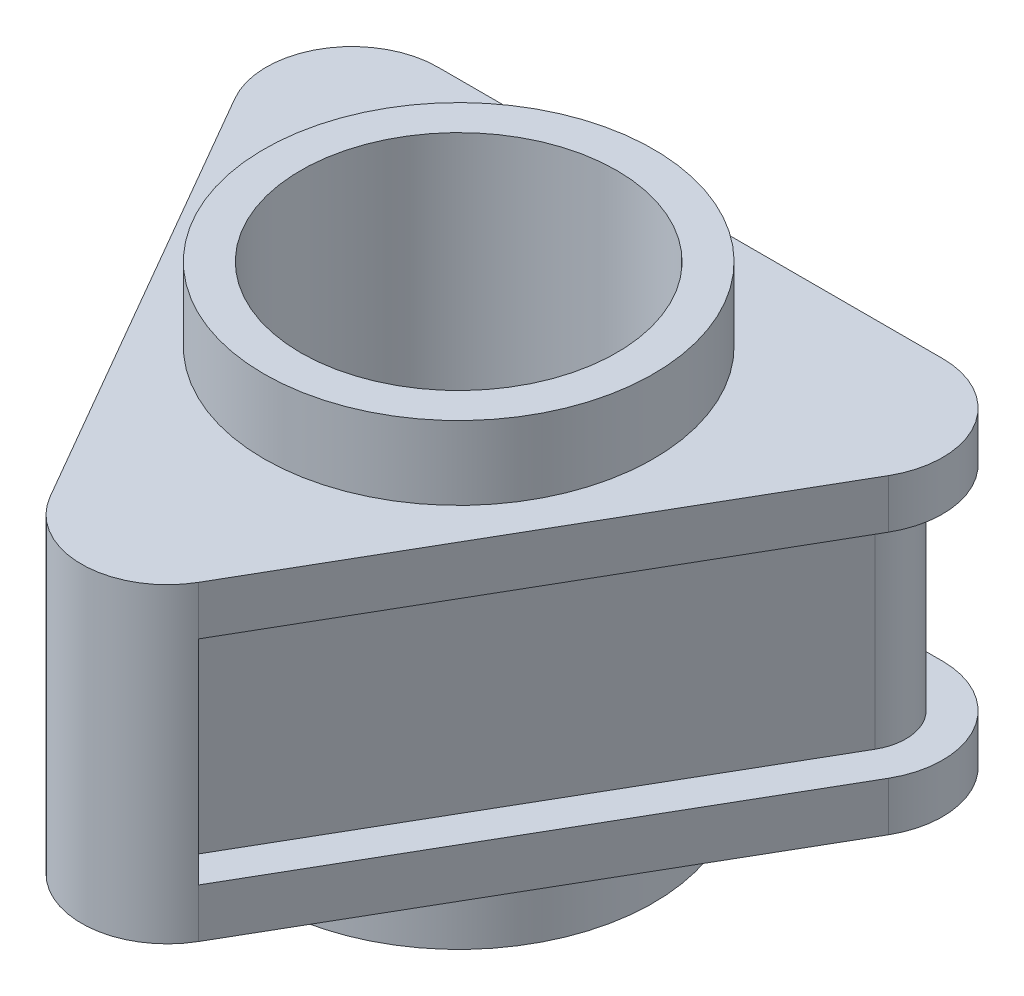
ISO-10303-21;
HEADER;
FILE_DESCRIPTION(('STEP AP214'),'2;1');
FILE_NAME('part.step','',(''),(''),'','','');
FILE_SCHEMA(('AUTOMOTIVE_DESIGN { 1 0 10303 214 1 1 1 1 }'));
ENDSEC;
DATA;
#1=APPLICATION_CONTEXT('core data for automotive mechanical design processes');
#2=APPLICATION_PROTOCOL_DEFINITION('international standard','automotive_design',2000,#1);
#3=PRODUCT_CONTEXT('',#1,'mechanical');
#4=PRODUCT('Part','Part','',(#3));
#5=PRODUCT_RELATED_PRODUCT_CATEGORY('part','',(#4));
#6=PRODUCT_DEFINITION_FORMATION('','',#4);
#7=PRODUCT_DEFINITION_CONTEXT('part definition',#1,'design');
#8=PRODUCT_DEFINITION('design','',#6,#7);
#9=PRODUCT_DEFINITION_SHAPE('','',#8);
#10=(LENGTH_UNIT() NAMED_UNIT(*) SI_UNIT(.MILLI.,.METRE.));
#11=(NAMED_UNIT(*) PLANE_ANGLE_UNIT() SI_UNIT($,.RADIAN.));
#12=(NAMED_UNIT(*) SI_UNIT($,.STERADIAN.) SOLID_ANGLE_UNIT());
#13=UNCERTAINTY_MEASURE_WITH_UNIT(LENGTH_MEASURE(1.E-05),#10,'distance_accuracy_value','');
#14=(GEOMETRIC_REPRESENTATION_CONTEXT(3) GLOBAL_UNCERTAINTY_ASSIGNED_CONTEXT((#13)) GLOBAL_UNIT_ASSIGNED_CONTEXT((#10,
#11,#12)) REPRESENTATION_CONTEXT('',''));
#15=CARTESIAN_POINT('',(0.,0.,0.));
#16=DIRECTION('',(0.,0.,1.));
#17=DIRECTION('',(1.,0.,0.));
#18=AXIS2_PLACEMENT_3D('',#15,#16,#17);
#19=CARTESIAN_POINT('',(0.,6.35,11.9));
#20=DIRECTION('',(0.,-1.,0.));
#21=DIRECTION('',(0.,0.,-1.));
#22=AXIS2_PLACEMENT_3D('',#19,#20,#21);
#23=CYLINDRICAL_SURFACE('',#22,2.);
#24=CARTESIAN_POINT('',(0.,-4.35,11.9));
#25=DIRECTION('',(0.,-1.,0.));
#26=DIRECTION('',(0.,0.,-1.));
#27=AXIS2_PLACEMENT_3D('',#24,#25,#26);
#28=CIRCLE('',#27,2.);
#29=CARTESIAN_POINT('',(-0.999999999999988,-4.35,13.6320508075689));
#30=VERTEX_POINT('',#29);
#31=CARTESIAN_POINT('',(-1.73205080756887,-4.35,12.9));
#32=VERTEX_POINT('',#31);
#33=EDGE_CURVE('E249',#30,#32,#28,.T.);
#34=ORIENTED_EDGE('',*,*,#33,.F.);
#35=DIRECTION('',(0.,1.,0.));
#36=VECTOR('',#35,1.);
#37=CARTESIAN_POINT('',(-0.999999999999987,-10.8162585781888,13.6320508075689));
#38=LINE('',#37,#36);
#39=CARTESIAN_POINT('',(-0.999999999999987,4.35,13.6320508075689));
#40=VERTEX_POINT('',#39);
#41=EDGE_CURVE('E237',#30,#40,#38,.T.);
#42=ORIENTED_EDGE('',*,*,#41,.T.);
#43=CARTESIAN_POINT('',(0.,4.35,11.9));
#44=DIRECTION('',(0.,1.,0.));
#45=DIRECTION('',(0.,0.,1.));
#46=AXIS2_PLACEMENT_3D('',#43,#44,#45);
#47=CIRCLE('',#46,2.);
#48=CARTESIAN_POINT('',(-1.73205080756887,4.35,12.9));
#49=VERTEX_POINT('',#48);
#50=EDGE_CURVE('E317',#49,#40,#47,.T.);
#51=ORIENTED_EDGE('',*,*,#50,.F.);
#52=DIRECTION('',(0.,-1.,0.));
#53=VECTOR('',#52,1.);
#54=CARTESIAN_POINT('',(-1.73205080756887,6.35,12.9));
#55=LINE('',#54,#53);
#56=EDGE_CURVE('E42',#32,#49,#55,.F.);
#57=ORIENTED_EDGE('',*,*,#56,.F.);
#58=EDGE_LOOP('',(#34,#42,#51,#57));
#59=FACE_BOUND('',#58,.T.);
#60=ADVANCED_FACE('F35',(#59),#23,.T.);
#61=CARTESIAN_POINT('',(1.,4.35,13.6320508075689));
#62=VERTEX_POINT('',#61);
#63=CARTESIAN_POINT('',(1.73205080756888,4.35,12.9));
#64=VERTEX_POINT('',#63);
#65=EDGE_CURVE('E316',#62,#64,#47,.T.);
#66=ORIENTED_EDGE('',*,*,#65,.F.);
#67=DIRECTION('',(0.,1.,0.));
#68=VECTOR('',#67,1.);
#69=CARTESIAN_POINT('',(1.00000000000001,-10.8162585781888,13.6320508075689));
#70=LINE('',#69,#68);
#71=CARTESIAN_POINT('',(1.,-4.35,13.6320508075689));
#72=VERTEX_POINT('',#71);
#73=EDGE_CURVE('E239',#72,#62,#70,.T.);
#74=ORIENTED_EDGE('',*,*,#73,.F.);
#75=CARTESIAN_POINT('',(1.73205080756888,-4.35,12.9));
#76=VERTEX_POINT('',#75);
#77=EDGE_CURVE('E250',#76,#72,#28,.T.);
#78=ORIENTED_EDGE('',*,*,#77,.F.);
#79=DIRECTION('',(0.,-1.,0.));
#80=VECTOR('',#79,1.);
#81=CARTESIAN_POINT('',(1.73205080756888,6.35,12.9));
#82=LINE('',#81,#80);
#83=EDGE_CURVE('E388',#64,#76,#82,.T.);
#84=ORIENTED_EDGE('',*,*,#83,.F.);
#85=EDGE_LOOP('',(#66,#74,#78,#84));
#86=FACE_BOUND('',#85,.T.);
#87=ADVANCED_FACE('F480',(#86),#23,.T.);
#88=CARTESIAN_POINT('',(10.3057023050348,4.35,-5.95));
#89=DIRECTION('',(0.,1.,0.));
#90=DIRECTION('',(0.,0.,1.));
#91=AXIS2_PLACEMENT_3D('',#88,#89,#90);
#92=PLANE('',#91);
#93=DIRECTION('',(0.866025403784441,0.,-0.499999999999996));
#94=VECTOR('',#93,1.);
#95=CARTESIAN_POINT('',(-2.16506350946109,4.35,13.15));
#96=LINE('',#95,#94);
#97=CARTESIAN_POINT('',(-3.03108891324553,4.35,13.65));
#98=VERTEX_POINT('',#97);
#99=CARTESIAN_POINT('',(-2.16506350946109,4.35,13.15));
#100=VERTEX_POINT('',#99);
#101=EDGE_CURVE('E232',#98,#100,#96,.T.);
#102=ORIENTED_EDGE('',*,*,#101,.F.);
#103=DIRECTION('',(0.500000000000001,0.,0.866025403784438));
#104=VECTOR('',#103,1.);
#105=CARTESIAN_POINT('',(-13.3367912182804,4.35,-4.2));
#106=LINE('',#105,#104);
#107=CARTESIAN_POINT('',(-13.3367912182804,4.35,-4.2));
#108=VERTEX_POINT('',#107);
#109=EDGE_CURVE('E331',#108,#98,#106,.T.);
#110=ORIENTED_EDGE('',*,*,#109,.F.);
#111=CARTESIAN_POINT('',(-10.3057023050348,4.35,-5.95));
#112=DIRECTION('',(0.,1.,0.));
#113=DIRECTION('',(0.,0.,1.));
#114=AXIS2_PLACEMENT_3D('',#111,#112,#113);
#115=CIRCLE('',#114,3.5);
#116=CARTESIAN_POINT('',(-10.3057023050348,4.35,-9.45));
#117=VERTEX_POINT('',#116);
#118=EDGE_CURVE('E328',#117,#108,#115,.T.);
#119=ORIENTED_EDGE('',*,*,#118,.F.);
#120=DIRECTION('',(-1.,0.,0.));
#121=VECTOR('',#120,1.);
#122=CARTESIAN_POINT('',(10.3057023050348,4.35,-9.45));
#123=LINE('',#122,#121);
#124=CARTESIAN_POINT('',(10.3057023050348,4.35,-9.45));
#125=VERTEX_POINT('',#124);
#126=EDGE_CURVE('E326',#125,#117,#123,.T.);
#127=ORIENTED_EDGE('',*,*,#126,.F.);
#128=CARTESIAN_POINT('',(10.3057023050348,4.35,-5.95));
#129=DIRECTION('',(0.,1.,0.));
#130=DIRECTION('',(0.,0.,1.));
#131=AXIS2_PLACEMENT_3D('',#128,#129,#130);
#132=CIRCLE('',#131,3.5);
#133=CARTESIAN_POINT('',(13.3367912182804,4.35,-4.2));
#134=VERTEX_POINT('',#133);
#135=EDGE_CURVE('E322',#134,#125,#132,.T.);
#136=ORIENTED_EDGE('',*,*,#135,.F.);
#137=DIRECTION('',(0.499999999999999,0.,-0.866025403784439));
#138=VECTOR('',#137,1.);
#139=CARTESIAN_POINT('',(3.03108891324554,4.35,13.65));
#140=LINE('',#139,#138);
#141=CARTESIAN_POINT('',(3.03108891324554,4.35,13.65));
#142=VERTEX_POINT('',#141);
#143=EDGE_CURVE('E320',#142,#134,#140,.T.);
#144=ORIENTED_EDGE('',*,*,#143,.F.);
#145=DIRECTION('',(0.866025403784439,0.,0.499999999999999));
#146=VECTOR('',#145,1.);
#147=CARTESIAN_POINT('',(2.1650635094611,4.35,13.15));
#148=LINE('',#147,#146);
#149=CARTESIAN_POINT('',(2.1650635094611,4.35,13.15));
#150=VERTEX_POINT('',#149);
#151=EDGE_CURVE('E216',#150,#142,#148,.T.);
#152=ORIENTED_EDGE('',*,*,#151,.F.);
#153=CARTESIAN_POINT('',(0.,4.35,11.9));
#154=DIRECTION('',(0.,1.,0.));
#155=DIRECTION('',(0.,0.,-1.));
#156=AXIS2_PLACEMENT_3D('',#153,#154,#155);
#157=CIRCLE('',#156,2.5);
#158=CARTESIAN_POINT('',(1.48431348329845,4.35,13.9116693275234));
#159=VERTEX_POINT('',#158);
#160=EDGE_CURVE('E213',#159,#150,#157,.T.);
#161=ORIENTED_EDGE('',*,*,#160,.F.);
#162=DIRECTION('',(0.866025403784437,0.,0.500000000000002));
#163=VECTOR('',#162,1.);
#164=CARTESIAN_POINT('',(1.00000000000001,4.35,13.6320508075689));
#165=LINE('',#164,#163);
#166=EDGE_CURVE('E242',#62,#159,#165,.T.);
#167=ORIENTED_EDGE('',*,*,#166,.F.);
#168=ORIENTED_EDGE('',*,*,#65,.T.);
#169=DIRECTION('',(0.499999999999999,0.,-0.866025403784439));
#170=VECTOR('',#169,1.);
#171=CARTESIAN_POINT('',(1.73205080756888,4.35,12.9));
#172=LINE('',#171,#170);
#173=CARTESIAN_POINT('',(12.0377531126037,4.35,-4.95));
#174=VERTEX_POINT('',#173);
#175=EDGE_CURVE('E294',#64,#174,#172,.T.);
#176=ORIENTED_EDGE('',*,*,#175,.T.);
#177=CARTESIAN_POINT('',(10.3057023050348,4.35,-5.95));
#178=DIRECTION('',(0.,1.,0.));
#179=DIRECTION('',(0.,0.,1.));
#180=AXIS2_PLACEMENT_3D('',#177,#178,#179);
#181=CIRCLE('',#180,2.);
#182=CARTESIAN_POINT('',(10.3057023050348,4.35,-7.95));
#183=VERTEX_POINT('',#182);
#184=EDGE_CURVE('E306',#174,#183,#181,.T.);
#185=ORIENTED_EDGE('',*,*,#184,.T.);
#186=DIRECTION('',(-1.,0.,0.));
#187=VECTOR('',#186,1.);
#188=CARTESIAN_POINT('',(10.3057023050348,4.35,-7.95));
#189=LINE('',#188,#187);
#190=CARTESIAN_POINT('',(-10.3057023050348,4.35,-7.95));
#191=VERTEX_POINT('',#190);
#192=EDGE_CURVE('E308',#183,#191,#189,.T.);
#193=ORIENTED_EDGE('',*,*,#192,.T.);
#194=CARTESIAN_POINT('',(-10.3057023050348,4.35,-5.95));
#195=DIRECTION('',(0.,1.,0.));
#196=DIRECTION('',(0.,0.,1.));
#197=AXIS2_PLACEMENT_3D('',#194,#195,#196);
#198=CIRCLE('',#197,2.);
#199=CARTESIAN_POINT('',(-12.0377531126037,4.35,-4.95));
#200=VERTEX_POINT('',#199);
#201=EDGE_CURVE('E311',#191,#200,#198,.T.);
#202=ORIENTED_EDGE('',*,*,#201,.T.);
#203=DIRECTION('',(0.500000000000001,0.,0.866025403784438));
#204=VECTOR('',#203,1.);
#205=CARTESIAN_POINT('',(-12.0377531126037,4.35,-4.95));
#206=LINE('',#205,#204);
#207=EDGE_CURVE('E313',#200,#49,#206,.T.);
#208=ORIENTED_EDGE('',*,*,#207,.T.);
#209=ORIENTED_EDGE('',*,*,#50,.T.);
#210=DIRECTION('',(0.86602540378444,0.,-0.499999999999998));
#211=VECTOR('',#210,1.);
#212=CARTESIAN_POINT('',(-0.999999999999988,4.35,13.6320508075689));
#213=LINE('',#212,#211);
#214=CARTESIAN_POINT('',(-1.48431348329843,4.35,13.9116693275234));
#215=VERTEX_POINT('',#214);
#216=EDGE_CURVE('E54',#215,#40,#213,.T.);
#217=ORIENTED_EDGE('',*,*,#216,.F.);
#218=CARTESIAN_POINT('',(0.,4.35,11.9));
#219=DIRECTION('',(0.,1.,0.));
#220=DIRECTION('',(0.,0.,-1.));
#221=AXIS2_PLACEMENT_3D('',#218,#219,#220);
#222=CIRCLE('',#221,2.5);
#223=EDGE_CURVE('E49',#100,#215,#222,.T.);
#224=ORIENTED_EDGE('',*,*,#223,.F.);
#225=EDGE_LOOP('',(#102,#110,#119,#127,#136,#144,#152,#161,#167,#168,#176,#185,#193,#202,#208,
#209,#217,#224));
#226=FACE_BOUND('',#225,.T.);
#227=ADVANCED_FACE('F401',(#226),#92,.F.);
#228=CARTESIAN_POINT('',(10.3057023050348,-4.35,-5.95));
#229=DIRECTION('',(0.,-1.,0.));
#230=DIRECTION('',(0.,0.,-1.));
#231=AXIS2_PLACEMENT_3D('',#228,#229,#230);
#232=PLANE('',#231);
#233=DIRECTION('',(0.866025403784441,0.,-0.499999999999996));
#234=VECTOR('',#233,1.);
#235=CARTESIAN_POINT('',(-2.16506350946109,-4.35,13.15));
#236=LINE('',#235,#234);
#237=CARTESIAN_POINT('',(-3.03108891324553,-4.35,13.65));
#238=VERTEX_POINT('',#237);
#239=CARTESIAN_POINT('',(-2.16506350946109,-4.35,13.15));
#240=VERTEX_POINT('',#239);
#241=EDGE_CURVE('E222',#238,#240,#236,.T.);
#242=ORIENTED_EDGE('',*,*,#241,.T.);
#243=CARTESIAN_POINT('',(0.,-4.35,11.9));
#244=DIRECTION('',(0.,-1.,0.));
#245=DIRECTION('',(0.,0.,-1.));
#246=AXIS2_PLACEMENT_3D('',#243,#244,#245);
#247=CIRCLE('',#246,2.5);
#248=CARTESIAN_POINT('',(-1.48431348329843,-4.35,13.9116693275234));
#249=VERTEX_POINT('',#248);
#250=EDGE_CURVE('E224',#240,#249,#247,.F.);
#251=ORIENTED_EDGE('',*,*,#250,.T.);
#252=DIRECTION('',(0.86602540378444,0.,-0.499999999999998));
#253=VECTOR('',#252,1.);
#254=CARTESIAN_POINT('',(-0.999999999999988,-4.35,13.6320508075689));
#255=LINE('',#254,#253);
#256=EDGE_CURVE('E407',#249,#30,#255,.T.);
#257=ORIENTED_EDGE('',*,*,#256,.T.);
#258=ORIENTED_EDGE('',*,*,#33,.T.);
#259=DIRECTION('',(-0.5,0.,-0.866025403784438));
#260=VECTOR('',#259,1.);
#261=CARTESIAN_POINT('',(-12.0377531126037,-4.35,-4.95));
#262=LINE('',#261,#260);
#263=CARTESIAN_POINT('',(-12.0377531126037,-4.35,-4.95));
#264=VERTEX_POINT('',#263);
#265=EDGE_CURVE('E252',#32,#264,#262,.T.);
#266=ORIENTED_EDGE('',*,*,#265,.T.);
#267=CARTESIAN_POINT('',(-10.3057023050348,-4.35,-5.95));
#268=DIRECTION('',(0.,-1.,0.));
#269=DIRECTION('',(0.,0.,-1.));
#270=AXIS2_PLACEMENT_3D('',#267,#268,#269);
#271=CIRCLE('',#270,2.);
#272=CARTESIAN_POINT('',(-10.3057023050348,-4.35,-7.95));
#273=VERTEX_POINT('',#272);
#274=EDGE_CURVE('E254',#264,#273,#271,.T.);
#275=ORIENTED_EDGE('',*,*,#274,.T.);
#276=DIRECTION('',(1.,0.,0.));
#277=VECTOR('',#276,1.);
#278=CARTESIAN_POINT('',(10.3057023050348,-4.35,-7.95));
#279=LINE('',#278,#277);
#280=CARTESIAN_POINT('',(10.3057023050348,-4.35,-7.95));
#281=VERTEX_POINT('',#280);
#282=EDGE_CURVE('E256',#273,#281,#279,.T.);
#283=ORIENTED_EDGE('',*,*,#282,.T.);
#284=CARTESIAN_POINT('',(10.3057023050348,-4.35,-5.95));
#285=DIRECTION('',(0.,-1.,0.));
#286=DIRECTION('',(0.,0.,-1.));
#287=AXIS2_PLACEMENT_3D('',#284,#285,#286);
#288=CIRCLE('',#287,2.);
#289=CARTESIAN_POINT('',(12.0377531126037,-4.35,-4.95));
#290=VERTEX_POINT('',#289);
#291=EDGE_CURVE('E207',#281,#290,#288,.T.);
#292=ORIENTED_EDGE('',*,*,#291,.T.);
#293=DIRECTION('',(-0.5,0.,0.866025403784439));
#294=VECTOR('',#293,1.);
#295=CARTESIAN_POINT('',(1.73205080756888,-4.35,12.9));
#296=LINE('',#295,#294);
#297=EDGE_CURVE('E247',#290,#76,#296,.T.);
#298=ORIENTED_EDGE('',*,*,#297,.T.);
#299=ORIENTED_EDGE('',*,*,#77,.T.);
#300=DIRECTION('',(0.866025403784438,0.,0.500000000000002));
#301=VECTOR('',#300,1.);
#302=CARTESIAN_POINT('',(1.00000000000001,-4.35,13.6320508075689));
#303=LINE('',#302,#301);
#304=CARTESIAN_POINT('',(1.48431348329845,-4.35,13.9116693275234));
#305=VERTEX_POINT('',#304);
#306=EDGE_CURVE('E203',#72,#305,#303,.T.);
#307=ORIENTED_EDGE('',*,*,#306,.T.);
#308=CARTESIAN_POINT('',(0.,-4.35,11.9));
#309=DIRECTION('',(0.,-1.,0.));
#310=DIRECTION('',(0.,0.,-1.));
#311=AXIS2_PLACEMENT_3D('',#308,#309,#310);
#312=CIRCLE('',#311,2.5);
#313=CARTESIAN_POINT('',(2.1650635094611,-4.35,13.15));
#314=VERTEX_POINT('',#313);
#315=EDGE_CURVE('E194',#305,#314,#312,.F.);
#316=ORIENTED_EDGE('',*,*,#315,.T.);
#317=DIRECTION('',(0.866025403784439,0.,0.499999999999999));
#318=VECTOR('',#317,1.);
#319=CARTESIAN_POINT('',(2.1650635094611,-4.35,13.15));
#320=LINE('',#319,#318);
#321=CARTESIAN_POINT('',(3.03108891324554,-4.35,13.65));
#322=VERTEX_POINT('',#321);
#323=EDGE_CURVE('E199',#314,#322,#320,.T.);
#324=ORIENTED_EDGE('',*,*,#323,.T.);
#325=DIRECTION('',(-0.5,0.,0.866025403784439));
#326=VECTOR('',#325,1.);
#327=CARTESIAN_POINT('',(13.3367912182804,-4.35,-4.2));
#328=LINE('',#327,#326);
#329=CARTESIAN_POINT('',(13.3367912182804,-4.35,-4.2));
#330=VERTEX_POINT('',#329);
#331=EDGE_CURVE('E262',#330,#322,#328,.T.);
#332=ORIENTED_EDGE('',*,*,#331,.F.);
#333=CARTESIAN_POINT('',(10.3057023050348,-4.35,-5.95));
#334=DIRECTION('',(0.,-1.,0.));
#335=DIRECTION('',(0.,0.,-1.));
#336=AXIS2_PLACEMENT_3D('',#333,#334,#335);
#337=CIRCLE('',#336,3.5);
#338=CARTESIAN_POINT('',(10.3057023050348,-4.35,-9.45));
#339=VERTEX_POINT('',#338);
#340=EDGE_CURVE('E259',#339,#330,#337,.T.);
#341=ORIENTED_EDGE('',*,*,#340,.F.);
#342=DIRECTION('',(1.,0.,0.));
#343=VECTOR('',#342,1.);
#344=CARTESIAN_POINT('',(-10.3057023050348,-4.35,-9.45));
#345=LINE('',#344,#343);
#346=CARTESIAN_POINT('',(-10.3057023050348,-4.35,-9.45));
#347=VERTEX_POINT('',#346);
#348=EDGE_CURVE('E272',#347,#339,#345,.T.);
#349=ORIENTED_EDGE('',*,*,#348,.F.);
#350=CARTESIAN_POINT('',(-10.3057023050348,-4.35,-5.95));
#351=DIRECTION('',(0.,-1.,0.));
#352=DIRECTION('',(0.,0.,-1.));
#353=AXIS2_PLACEMENT_3D('',#350,#351,#352);
#354=CIRCLE('',#353,3.5);
#355=CARTESIAN_POINT('',(-13.3367912182804,-4.35,-4.2));
#356=VERTEX_POINT('',#355);
#357=EDGE_CURVE('E269',#356,#347,#354,.T.);
#358=ORIENTED_EDGE('',*,*,#357,.F.);
#359=DIRECTION('',(-0.5,0.,-0.866025403784438));
#360=VECTOR('',#359,1.);
#361=CARTESIAN_POINT('',(-3.03108891324553,-4.35,13.65));
#362=LINE('',#361,#360);
#363=EDGE_CURVE('E266',#238,#356,#362,.T.);
#364=ORIENTED_EDGE('',*,*,#363,.F.);
#365=EDGE_LOOP('',(#242,#251,#257,#258,#266,#275,#283,#292,#298,#299,#307,#316,#324,#332,#341,
#349,#358,#364));
#366=FACE_BOUND('',#365,.T.);
#367=ADVANCED_FACE('F196',(#366),#232,.F.);
#368=CARTESIAN_POINT('',(-13.7698039201726,6.35,-7.95));
#369=DIRECTION('',(0.866025403784438,0.,-0.5));
#370=DIRECTION('',(-0.500000000000001,0.,-0.866025403784438));
#371=AXIS2_PLACEMENT_3D('',#368,#369,#370);
#372=PLANE('',#371);
#373=ORIENTED_EDGE('',*,*,#265,.F.);
#374=ORIENTED_EDGE('',*,*,#56,.T.);
#375=ORIENTED_EDGE('',*,*,#207,.F.);
#376=DIRECTION('',(0.,-1.,0.));
#377=VECTOR('',#376,1.);
#378=CARTESIAN_POINT('',(-12.0377531126037,6.35,-4.95));
#379=LINE('',#378,#377);
#380=EDGE_CURVE('E12',#200,#264,#379,.T.);
#381=ORIENTED_EDGE('',*,*,#380,.T.);
#382=EDGE_LOOP('',(#373,#374,#375,#381));
#383=FACE_BOUND('',#382,.T.);
#384=ADVANCED_FACE('F396',(#383),#372,.F.);
#385=CARTESIAN_POINT('',(0.,6.35,15.9));
#386=DIRECTION('',(-0.866025403784439,0.,-0.5));
#387=DIRECTION('',(-0.5,0.,0.866025403784439));
#388=AXIS2_PLACEMENT_3D('',#385,#386,#387);
#389=PLANE('',#388);
#390=ORIENTED_EDGE('',*,*,#297,.F.);
#391=DIRECTION('',(0.,-1.,0.));
#392=VECTOR('',#391,1.);
#393=CARTESIAN_POINT('',(12.0377531126037,6.35,-4.95));
#394=LINE('',#393,#392);
#395=EDGE_CURVE('E391',#290,#174,#394,.F.);
#396=ORIENTED_EDGE('',*,*,#395,.T.);
#397=ORIENTED_EDGE('',*,*,#175,.F.);
#398=ORIENTED_EDGE('',*,*,#83,.T.);
#399=EDGE_LOOP('',(#390,#396,#397,#398));
#400=FACE_BOUND('',#399,.T.);
#401=ADVANCED_FACE('F514',(#400),#389,.F.);
#402=CARTESIAN_POINT('',(13.7698039201726,6.35,-7.95));
#403=DIRECTION('',(0.,0.,1.));
#404=DIRECTION('',(1.,0.,0.));
#405=AXIS2_PLACEMENT_3D('',#402,#403,#404);
#406=PLANE('',#405);
#407=ORIENTED_EDGE('',*,*,#282,.F.);
#408=DIRECTION('',(0.,-1.,0.));
#409=VECTOR('',#408,1.);
#410=CARTESIAN_POINT('',(-10.3057023050348,6.35,-7.95));
#411=LINE('',#410,#409);
#412=EDGE_CURVE('E383',#273,#191,#411,.F.);
#413=ORIENTED_EDGE('',*,*,#412,.T.);
#414=ORIENTED_EDGE('',*,*,#192,.F.);
#415=DIRECTION('',(0.,-1.,0.));
#416=VECTOR('',#415,1.);
#417=CARTESIAN_POINT('',(10.3057023050348,6.35,-7.95));
#418=LINE('',#417,#416);
#419=EDGE_CURVE('E385',#183,#281,#418,.T.);
#420=ORIENTED_EDGE('',*,*,#419,.T.);
#421=EDGE_LOOP('',(#407,#413,#414,#420));
#422=FACE_BOUND('',#421,.T.);
#423=ADVANCED_FACE('F519',(#422),#406,.F.);
#424=CARTESIAN_POINT('',(10.3057023050348,6.35,-5.95));
#425=DIRECTION('',(0.,-1.,0.));
#426=DIRECTION('',(0.,0.,-1.));
#427=AXIS2_PLACEMENT_3D('',#424,#425,#426);
#428=CYLINDRICAL_SURFACE('',#427,2.);
#429=ORIENTED_EDGE('',*,*,#395,.F.);
#430=ORIENTED_EDGE('',*,*,#291,.F.);
#431=ORIENTED_EDGE('',*,*,#419,.F.);
#432=ORIENTED_EDGE('',*,*,#184,.F.);
#433=EDGE_LOOP('',(#429,#430,#431,#432));
#434=FACE_BOUND('',#433,.T.);
#435=ADVANCED_FACE('F524',(#434),#428,.T.);
#436=CARTESIAN_POINT('',(-10.3057023050348,6.35,-5.95));
#437=DIRECTION('',(0.,-1.,0.));
#438=DIRECTION('',(0.,0.,-1.));
#439=AXIS2_PLACEMENT_3D('',#436,#437,#438);
#440=CYLINDRICAL_SURFACE('',#439,2.);
#441=ORIENTED_EDGE('',*,*,#412,.F.);
#442=ORIENTED_EDGE('',*,*,#274,.F.);
#443=ORIENTED_EDGE('',*,*,#380,.F.);
#444=ORIENTED_EDGE('',*,*,#201,.F.);
#445=EDGE_LOOP('',(#441,#442,#443,#444));
#446=FACE_BOUND('',#445,.T.);
#447=ADVANCED_FACE('F526',(#446),#440,.T.);
#448=CARTESIAN_POINT('',(0.,6.35,15.9));
#449=DIRECTION('',(0.,1.,0.));
#450=DIRECTION('',(0.,0.,1.));
#451=AXIS2_PLACEMENT_3D('',#448,#449,#450);
#452=PLANE('',#451);
#453=CARTESIAN_POINT('',(0.,6.35,0.));
#454=DIRECTION('',(0.,1.,0.));
#455=DIRECTION('',(0.,0.,1.));
#456=AXIS2_PLACEMENT_3D('',#453,#454,#455);
#457=CIRCLE('',#456,7.95000000000001);
#458=CARTESIAN_POINT('',(0.,6.35,7.95000000000001));
#459=VERTEX_POINT('',#458);
#460=EDGE_CURVE('E380',#459,#459,#457,.T.);
#461=ORIENTED_EDGE('',*,*,#460,.F.);
#462=EDGE_LOOP('',(#461));
#463=FACE_BOUND('',#462,.T.);
#464=CARTESIAN_POINT('',(0.,6.35,11.9));
#465=DIRECTION('',(0.,1.,0.));
#466=DIRECTION('',(0.,0.,1.));
#467=AXIS2_PLACEMENT_3D('',#464,#465,#466);
#468=CIRCLE('',#467,3.5);
#469=CARTESIAN_POINT('',(-3.03108891324553,6.35,13.65));
#470=VERTEX_POINT('',#469);
#471=CARTESIAN_POINT('',(3.03108891324554,6.35,13.65));
#472=VERTEX_POINT('',#471);
#473=EDGE_CURVE('E323',#470,#472,#468,.T.);
#474=ORIENTED_EDGE('',*,*,#473,.T.);
#475=DIRECTION('',(0.5,0.,-0.866025403784439));
#476=VECTOR('',#475,1.);
#477=CARTESIAN_POINT('',(8.18394006576295,6.35,4.725));
#478=LINE('',#477,#476);
#479=CARTESIAN_POINT('',(13.3367912182804,6.35,-4.2));
#480=VERTEX_POINT('',#479);
#481=EDGE_CURVE('E319',#472,#480,#478,.T.);
#482=ORIENTED_EDGE('',*,*,#481,.T.);
#483=CARTESIAN_POINT('',(10.3057023050348,6.35,-5.95));
#484=DIRECTION('',(0.,1.,0.));
#485=DIRECTION('',(0.,0.,1.));
#486=AXIS2_PLACEMENT_3D('',#483,#484,#485);
#487=CIRCLE('',#486,3.5);
#488=CARTESIAN_POINT('',(10.3057023050348,6.35,-9.45));
#489=VERTEX_POINT('',#488);
#490=EDGE_CURVE('E337',#480,#489,#487,.T.);
#491=ORIENTED_EDGE('',*,*,#490,.T.);
#492=DIRECTION('',(-1.,0.,0.));
#493=VECTOR('',#492,1.);
#494=CARTESIAN_POINT('',(0.,6.35,-9.45));
#495=LINE('',#494,#493);
#496=CARTESIAN_POINT('',(-10.3057023050348,6.35,-9.45));
#497=VERTEX_POINT('',#496);
#498=EDGE_CURVE('E340',#489,#497,#495,.T.);
#499=ORIENTED_EDGE('',*,*,#498,.T.);
#500=CARTESIAN_POINT('',(-10.3057023050348,6.35,-5.95));
#501=DIRECTION('',(0.,1.,0.));
#502=DIRECTION('',(0.,0.,1.));
#503=AXIS2_PLACEMENT_3D('',#500,#501,#502);
#504=CIRCLE('',#503,3.5);
#505=CARTESIAN_POINT('',(-13.3367912182804,6.35,-4.2));
#506=VERTEX_POINT('',#505);
#507=EDGE_CURVE('E343',#497,#506,#504,.T.);
#508=ORIENTED_EDGE('',*,*,#507,.T.);
#509=DIRECTION('',(0.5,0.,0.866025403784438));
#510=VECTOR('',#509,1.);
#511=CARTESIAN_POINT('',(-8.18394006576294,6.35,4.725));
#512=LINE('',#511,#510);
#513=EDGE_CURVE('E346',#506,#470,#512,.T.);
#514=ORIENTED_EDGE('',*,*,#513,.T.);
#515=EDGE_LOOP('',(#474,#482,#491,#499,#508,#514));
#516=FACE_BOUND('',#515,.T.);
#517=ADVANCED_FACE('F435',(#463,#516),#452,.T.);
#518=CARTESIAN_POINT('',(0.,-6.35,15.9));
#519=DIRECTION('',(0.,1.,0.));
#520=DIRECTION('',(0.,0.,1.));
#521=AXIS2_PLACEMENT_3D('',#518,#519,#520);
#522=PLANE('',#521);
#523=CARTESIAN_POINT('',(0.,-6.35,0.));
#524=DIRECTION('',(0.,1.,0.));
#525=DIRECTION('',(0.,0.,1.));
#526=AXIS2_PLACEMENT_3D('',#523,#524,#525);
#527=CIRCLE('',#526,7.95000000000001);
#528=CARTESIAN_POINT('',(0.,-6.35,7.95000000000001));
#529=VERTEX_POINT('',#528);
#530=EDGE_CURVE('E375',#529,#529,#527,.T.);
#531=ORIENTED_EDGE('',*,*,#530,.T.);
#532=EDGE_LOOP('',(#531));
#533=FACE_BOUND('',#532,.T.);
#534=CARTESIAN_POINT('',(10.3057023050348,-6.35,-5.95));
#535=DIRECTION('',(0.,-1.,0.));
#536=DIRECTION('',(0.,0.,-1.));
#537=AXIS2_PLACEMENT_3D('',#534,#535,#536);
#538=CIRCLE('',#537,3.5);
#539=CARTESIAN_POINT('',(10.3057023050348,-6.35,-9.45));
#540=VERTEX_POINT('',#539);
#541=CARTESIAN_POINT('',(13.3367912182804,-6.35,-4.2));
#542=VERTEX_POINT('',#541);
#543=EDGE_CURVE('E258',#540,#542,#538,.T.);
#544=ORIENTED_EDGE('',*,*,#543,.T.);
#545=DIRECTION('',(-0.5,0.,0.866025403784439));
#546=VECTOR('',#545,1.);
#547=CARTESIAN_POINT('',(13.3367912182804,-6.35,-4.2));
#548=LINE('',#547,#546);
#549=CARTESIAN_POINT('',(3.03108891324554,-6.35,13.65));
#550=VERTEX_POINT('',#549);
#551=EDGE_CURVE('E278',#542,#550,#548,.T.);
#552=ORIENTED_EDGE('',*,*,#551,.T.);
#553=CARTESIAN_POINT('',(0.,-6.35,11.9));
#554=DIRECTION('',(0.,-1.,0.));
#555=DIRECTION('',(0.,0.,-1.));
#556=AXIS2_PLACEMENT_3D('',#553,#554,#555);
#557=CIRCLE('',#556,3.5);
#558=CARTESIAN_POINT('',(-3.03108891324553,-6.35,13.65));
#559=VERTEX_POINT('',#558);
#560=EDGE_CURVE('E281',#550,#559,#557,.T.);
#561=ORIENTED_EDGE('',*,*,#560,.T.);
#562=DIRECTION('',(-0.5,0.,-0.866025403784438));
#563=VECTOR('',#562,1.);
#564=CARTESIAN_POINT('',(-3.03108891324553,-6.35,13.65));
#565=LINE('',#564,#563);
#566=CARTESIAN_POINT('',(-13.3367912182804,-6.35,-4.2));
#567=VERTEX_POINT('',#566);
#568=EDGE_CURVE('E284',#559,#567,#565,.T.);
#569=ORIENTED_EDGE('',*,*,#568,.T.);
#570=CARTESIAN_POINT('',(-10.3057023050348,-6.35,-5.95));
#571=DIRECTION('',(0.,-1.,0.));
#572=DIRECTION('',(0.,0.,-1.));
#573=AXIS2_PLACEMENT_3D('',#570,#571,#572);
#574=CIRCLE('',#573,3.5);
#575=CARTESIAN_POINT('',(-10.3057023050348,-6.35,-9.45));
#576=VERTEX_POINT('',#575);
#577=EDGE_CURVE('E287',#567,#576,#574,.T.);
#578=ORIENTED_EDGE('',*,*,#577,.T.);
#579=DIRECTION('',(1.,0.,0.));
#580=VECTOR('',#579,1.);
#581=CARTESIAN_POINT('',(-10.3057023050348,-6.35,-9.45));
#582=LINE('',#581,#580);
#583=EDGE_CURVE('E263',#576,#540,#582,.T.);
#584=ORIENTED_EDGE('',*,*,#583,.T.);
#585=EDGE_LOOP('',(#544,#552,#561,#569,#578,#584));
#586=FACE_BOUND('',#585,.T.);
#587=ADVANCED_FACE('F469',(#533,#586),#522,.F.);
#588=CARTESIAN_POINT('',(0.,-34.8359956417322,0.));
#589=DIRECTION('',(0.,1.,0.));
#590=DIRECTION('',(0.,0.,1.));
#591=AXIS2_PLACEMENT_3D('',#588,#589,#590);
#592=CYLINDRICAL_SURFACE('',#591,7.95000000000001);
#593=CARTESIAN_POINT('',(0.,-9.35,0.));
#594=DIRECTION('',(0.,1.,0.));
#595=DIRECTION('',(0.,0.,1.));
#596=AXIS2_PLACEMENT_3D('',#593,#594,#595);
#597=CIRCLE('',#596,7.95000000000001);
#598=CARTESIAN_POINT('',(0.,-9.35,7.95000000000001));
#599=VERTEX_POINT('',#598);
#600=EDGE_CURVE('E372',#599,#599,#597,.F.);
#601=ORIENTED_EDGE('',*,*,#600,.F.);
#602=EDGE_LOOP('',(#601));
#603=FACE_BOUND('',#602,.T.);
#604=ORIENTED_EDGE('',*,*,#530,.F.);
#605=EDGE_LOOP('',(#604));
#606=FACE_BOUND('',#605,.T.);
#607=ADVANCED_FACE('F550',(#603,#606),#592,.T.);
#608=CARTESIAN_POINT('',(0.,-9.35,15.9));
#609=DIRECTION('',(0.,1.,0.));
#610=DIRECTION('',(0.,0.,1.));
#611=AXIS2_PLACEMENT_3D('',#608,#609,#610);
#612=PLANE('',#611);
#613=ORIENTED_EDGE('',*,*,#600,.T.);
#614=EDGE_LOOP('',(#613));
#615=FACE_BOUND('',#614,.T.);
#616=CARTESIAN_POINT('',(0.,-9.35,0.));
#617=DIRECTION('',(0.,1.,0.));
#618=DIRECTION('',(0.,0.,1.));
#619=AXIS2_PLACEMENT_3D('',#616,#617,#618);
#620=CIRCLE('',#619,6.45);
#621=CARTESIAN_POINT('',(0.,-9.35,6.45));
#622=VERTEX_POINT('',#621);
#623=EDGE_CURVE('E371',#622,#622,#620,.F.);
#624=ORIENTED_EDGE('',*,*,#623,.F.);
#625=EDGE_LOOP('',(#624));
#626=FACE_BOUND('',#625,.T.);
#627=ADVANCED_FACE('F557',(#615,#626),#612,.F.);
#628=CARTESIAN_POINT('',(0.,6.35,0.));
#629=DIRECTION('',(0.,-1.,0.));
#630=DIRECTION('',(0.,0.,-1.));
#631=AXIS2_PLACEMENT_3D('',#628,#629,#630);
#632=CYLINDRICAL_SURFACE('',#631,6.45);
#633=ORIENTED_EDGE('',*,*,#623,.T.);
#634=EDGE_LOOP('',(#633));
#635=FACE_BOUND('',#634,.T.);
#636=CARTESIAN_POINT('',(0.,9.35,0.));
#637=DIRECTION('',(0.,1.,0.));
#638=DIRECTION('',(0.,0.,1.));
#639=AXIS2_PLACEMENT_3D('',#636,#637,#638);
#640=CIRCLE('',#639,6.45);
#641=CARTESIAN_POINT('',(0.,9.35,6.45));
#642=VERTEX_POINT('',#641);
#643=EDGE_CURVE('E354',#642,#642,#640,.T.);
#644=ORIENTED_EDGE('',*,*,#643,.T.);
#645=EDGE_LOOP('',(#644));
#646=FACE_BOUND('',#645,.T.);
#647=ADVANCED_FACE('F553',(#635,#646),#632,.F.);
#648=CARTESIAN_POINT('',(0.,9.35,0.));
#649=DIRECTION('',(0.,1.,0.));
#650=DIRECTION('',(0.,0.,1.));
#651=AXIS2_PLACEMENT_3D('',#648,#649,#650);
#652=CIRCLE('',#651,7.95000000000001);
#653=CARTESIAN_POINT('',(0.,9.35,7.95000000000001));
#654=VERTEX_POINT('',#653);
#655=EDGE_CURVE('E368',#654,#654,#652,.T.);
#656=ORIENTED_EDGE('',*,*,#655,.F.);
#657=EDGE_LOOP('',(#656));
#658=FACE_BOUND('',#657,.T.);
#659=ORIENTED_EDGE('',*,*,#460,.T.);
#660=EDGE_LOOP('',(#659));
#661=FACE_BOUND('',#660,.T.);
#662=ADVANCED_FACE('F556',(#658,#661),#592,.T.);
#663=CARTESIAN_POINT('',(0.,9.35,0.));
#664=DIRECTION('',(0.,1.,0.));
#665=DIRECTION('',(0.,0.,1.));
#666=AXIS2_PLACEMENT_3D('',#663,#664,#665);
#667=PLANE('',#666);
#668=ORIENTED_EDGE('',*,*,#655,.T.);
#669=EDGE_LOOP('',(#668));
#670=FACE_BOUND('',#669,.T.);
#671=ORIENTED_EDGE('',*,*,#643,.F.);
#672=EDGE_LOOP('',(#671));
#673=FACE_BOUND('',#672,.T.);
#674=ADVANCED_FACE('F565',(#670,#673),#667,.T.);
#675=CARTESIAN_POINT('',(0.,4.35,11.9));
#676=DIRECTION('',(0.,1.,0.));
#677=DIRECTION('',(0.,0.,1.));
#678=AXIS2_PLACEMENT_3D('',#675,#676,#677);
#679=CYLINDRICAL_SURFACE('',#678,3.5);
#680=ORIENTED_EDGE('',*,*,#473,.F.);
#681=DIRECTION('',(0.,1.,0.));
#682=VECTOR('',#681,1.);
#683=CARTESIAN_POINT('',(-3.03108891324553,4.35,13.65));
#684=LINE('',#683,#682);
#685=EDGE_CURVE('E355',#98,#470,#684,.T.);
#686=ORIENTED_EDGE('',*,*,#685,.F.);
#687=DIRECTION('',(0.,1.,0.));
#688=VECTOR('',#687,1.);
#689=CARTESIAN_POINT('',(-3.03108891324553,-10.8162585781888,13.65));
#690=LINE('',#689,#688);
#691=EDGE_CURVE('E229',#238,#98,#690,.T.);
#692=ORIENTED_EDGE('',*,*,#691,.F.);
#693=DIRECTION('',(0.,-1.,0.));
#694=VECTOR('',#693,1.);
#695=CARTESIAN_POINT('',(-3.03108891324553,-4.35,13.65));
#696=LINE('',#695,#694);
#697=EDGE_CURVE('E299',#238,#559,#696,.T.);
#698=ORIENTED_EDGE('',*,*,#697,.T.);
#699=ORIENTED_EDGE('',*,*,#560,.F.);
#700=DIRECTION('',(0.,-1.,0.));
#701=VECTOR('',#700,1.);
#702=CARTESIAN_POINT('',(3.03108891324554,-4.35,13.65));
#703=LINE('',#702,#701);
#704=EDGE_CURVE('E301',#322,#550,#703,.T.);
#705=ORIENTED_EDGE('',*,*,#704,.F.);
#706=DIRECTION('',(0.,1.,0.));
#707=VECTOR('',#706,1.);
#708=CARTESIAN_POINT('',(3.03108891324554,-10.8162585781888,13.65));
#709=LINE('',#708,#707);
#710=EDGE_CURVE('E221',#322,#142,#709,.T.);
#711=ORIENTED_EDGE('',*,*,#710,.T.);
#712=DIRECTION('',(0.,1.,0.));
#713=VECTOR('',#712,1.);
#714=CARTESIAN_POINT('',(3.03108891324554,4.35,13.65));
#715=LINE('',#714,#713);
#716=EDGE_CURVE('E351',#142,#472,#715,.T.);
#717=ORIENTED_EDGE('',*,*,#716,.T.);
#718=EDGE_LOOP('',(#680,#686,#692,#698,#699,#705,#711,#717));
#719=FACE_BOUND('',#718,.T.);
#720=ADVANCED_FACE('F433',(#719),#679,.T.);
#721=CARTESIAN_POINT('',(-8.18394006576294,4.35,4.725));
#722=DIRECTION('',(-0.866025403784438,0.,0.5));
#723=DIRECTION('',(0.5,0.,0.866025403784438));
#724=AXIS2_PLACEMENT_3D('',#721,#722,#723);
#725=PLANE('',#724);
#726=ORIENTED_EDGE('',*,*,#513,.F.);
#727=DIRECTION('',(0.,1.,0.));
#728=VECTOR('',#727,1.);
#729=CARTESIAN_POINT('',(-13.3367912182804,4.35,-4.2));
#730=LINE('',#729,#728);
#731=EDGE_CURVE('E357',#108,#506,#730,.T.);
#732=ORIENTED_EDGE('',*,*,#731,.F.);
#733=ORIENTED_EDGE('',*,*,#109,.T.);
#734=ORIENTED_EDGE('',*,*,#685,.T.);
#735=EDGE_LOOP('',(#726,#732,#733,#734));
#736=FACE_BOUND('',#735,.T.);
#737=ADVANCED_FACE('F430',(#736),#725,.T.);
#738=CARTESIAN_POINT('',(-10.3057023050348,4.35,-5.95));
#739=DIRECTION('',(0.,1.,0.));
#740=DIRECTION('',(0.,0.,1.));
#741=AXIS2_PLACEMENT_3D('',#738,#739,#740);
#742=CYLINDRICAL_SURFACE('',#741,3.5);
#743=ORIENTED_EDGE('',*,*,#507,.F.);
#744=DIRECTION('',(0.,1.,0.));
#745=VECTOR('',#744,1.);
#746=CARTESIAN_POINT('',(-10.3057023050348,4.35,-9.45));
#747=LINE('',#746,#745);
#748=EDGE_CURVE('E360',#117,#497,#747,.T.);
#749=ORIENTED_EDGE('',*,*,#748,.F.);
#750=ORIENTED_EDGE('',*,*,#118,.T.);
#751=ORIENTED_EDGE('',*,*,#731,.T.);
#752=EDGE_LOOP('',(#743,#749,#750,#751));
#753=FACE_BOUND('',#752,.T.);
#754=ADVANCED_FACE('F438',(#753),#742,.T.);
#755=CARTESIAN_POINT('',(0.,4.35,-9.45));
#756=DIRECTION('',(0.,0.,-1.));
#757=DIRECTION('',(-1.,0.,0.));
#758=AXIS2_PLACEMENT_3D('',#755,#756,#757);
#759=PLANE('',#758);
#760=ORIENTED_EDGE('',*,*,#498,.F.);
#761=DIRECTION('',(0.,1.,0.));
#762=VECTOR('',#761,1.);
#763=CARTESIAN_POINT('',(10.3057023050348,4.35,-9.45));
#764=LINE('',#763,#762);
#765=EDGE_CURVE('E362',#125,#489,#764,.T.);
#766=ORIENTED_EDGE('',*,*,#765,.F.);
#767=ORIENTED_EDGE('',*,*,#126,.T.);
#768=ORIENTED_EDGE('',*,*,#748,.T.);
#769=EDGE_LOOP('',(#760,#766,#767,#768));
#770=FACE_BOUND('',#769,.T.);
#771=ADVANCED_FACE('F573',(#770),#759,.T.);
#772=CARTESIAN_POINT('',(10.3057023050348,4.35,-5.95));
#773=DIRECTION('',(0.,1.,0.));
#774=DIRECTION('',(0.,0.,1.));
#775=AXIS2_PLACEMENT_3D('',#772,#773,#774);
#776=CYLINDRICAL_SURFACE('',#775,3.5);
#777=ORIENTED_EDGE('',*,*,#490,.F.);
#778=DIRECTION('',(0.,1.,0.));
#779=VECTOR('',#778,1.);
#780=CARTESIAN_POINT('',(13.3367912182804,4.35,-4.2));
#781=LINE('',#780,#779);
#782=EDGE_CURVE('E334',#134,#480,#781,.T.);
#783=ORIENTED_EDGE('',*,*,#782,.F.);
#784=ORIENTED_EDGE('',*,*,#135,.T.);
#785=ORIENTED_EDGE('',*,*,#765,.T.);
#786=EDGE_LOOP('',(#777,#783,#784,#785));
#787=FACE_BOUND('',#786,.T.);
#788=ADVANCED_FACE('F447',(#787),#776,.T.);
#789=CARTESIAN_POINT('',(8.18394006576295,4.35,4.725));
#790=DIRECTION('',(0.866025403784439,0.,0.5));
#791=DIRECTION('',(0.5,0.,-0.866025403784439));
#792=AXIS2_PLACEMENT_3D('',#789,#790,#791);
#793=PLANE('',#792);
#794=ORIENTED_EDGE('',*,*,#481,.F.);
#795=ORIENTED_EDGE('',*,*,#716,.F.);
#796=ORIENTED_EDGE('',*,*,#143,.T.);
#797=ORIENTED_EDGE('',*,*,#782,.T.);
#798=EDGE_LOOP('',(#794,#795,#796,#797));
#799=FACE_BOUND('',#798,.T.);
#800=ADVANCED_FACE('F449',(#799),#793,.T.);
#801=CARTESIAN_POINT('',(10.3057023050348,-4.35,-5.95));
#802=DIRECTION('',(0.,-1.,0.));
#803=DIRECTION('',(0.,0.,-1.));
#804=AXIS2_PLACEMENT_3D('',#801,#802,#803);
#805=CYLINDRICAL_SURFACE('',#804,3.5);
#806=ORIENTED_EDGE('',*,*,#543,.F.);
#807=DIRECTION('',(0.,-1.,0.));
#808=VECTOR('',#807,1.);
#809=CARTESIAN_POINT('',(10.3057023050348,-4.35,-9.45));
#810=LINE('',#809,#808);
#811=EDGE_CURVE('E292',#339,#540,#810,.T.);
#812=ORIENTED_EDGE('',*,*,#811,.F.);
#813=ORIENTED_EDGE('',*,*,#340,.T.);
#814=DIRECTION('',(0.,-1.,0.));
#815=VECTOR('',#814,1.);
#816=CARTESIAN_POINT('',(13.3367912182804,-4.35,-4.2));
#817=LINE('',#816,#815);
#818=EDGE_CURVE('E275',#330,#542,#817,.T.);
#819=ORIENTED_EDGE('',*,*,#818,.T.);
#820=EDGE_LOOP('',(#806,#812,#813,#819));
#821=FACE_BOUND('',#820,.T.);
#822=ADVANCED_FACE('F458',(#821),#805,.T.);
#823=CARTESIAN_POINT('',(-10.3057023050348,-4.35,-9.45));
#824=DIRECTION('',(0.,0.,-1.));
#825=DIRECTION('',(-1.,0.,0.));
#826=AXIS2_PLACEMENT_3D('',#823,#824,#825);
#827=PLANE('',#826);
#828=ORIENTED_EDGE('',*,*,#583,.F.);
#829=DIRECTION('',(0.,-1.,0.));
#830=VECTOR('',#829,1.);
#831=CARTESIAN_POINT('',(-10.3057023050348,-4.35,-9.45));
#832=LINE('',#831,#830);
#833=EDGE_CURVE('E295',#347,#576,#832,.T.);
#834=ORIENTED_EDGE('',*,*,#833,.F.);
#835=ORIENTED_EDGE('',*,*,#348,.T.);
#836=ORIENTED_EDGE('',*,*,#811,.T.);
#837=EDGE_LOOP('',(#828,#834,#835,#836));
#838=FACE_BOUND('',#837,.T.);
#839=ADVANCED_FACE('F461',(#838),#827,.T.);
#840=CARTESIAN_POINT('',(-10.3057023050348,-4.35,-5.95));
#841=DIRECTION('',(0.,-1.,0.));
#842=DIRECTION('',(0.,0.,-1.));
#843=AXIS2_PLACEMENT_3D('',#840,#841,#842);
#844=CYLINDRICAL_SURFACE('',#843,3.5);
#845=ORIENTED_EDGE('',*,*,#577,.F.);
#846=DIRECTION('',(0.,-1.,0.));
#847=VECTOR('',#846,1.);
#848=CARTESIAN_POINT('',(-13.3367912182804,-4.35,-4.2));
#849=LINE('',#848,#847);
#850=EDGE_CURVE('E297',#356,#567,#849,.T.);
#851=ORIENTED_EDGE('',*,*,#850,.F.);
#852=ORIENTED_EDGE('',*,*,#357,.T.);
#853=ORIENTED_EDGE('',*,*,#833,.T.);
#854=EDGE_LOOP('',(#845,#851,#852,#853));
#855=FACE_BOUND('',#854,.T.);
#856=ADVANCED_FACE('F470',(#855),#844,.T.);
#857=CARTESIAN_POINT('',(-3.03108891324553,-4.35,13.65));
#858=DIRECTION('',(-0.866025403784438,0.,0.500000000000001));
#859=DIRECTION('',(0.500000000000001,0.,0.866025403784438));
#860=AXIS2_PLACEMENT_3D('',#857,#858,#859);
#861=PLANE('',#860);
#862=ORIENTED_EDGE('',*,*,#568,.F.);
#863=ORIENTED_EDGE('',*,*,#697,.F.);
#864=ORIENTED_EDGE('',*,*,#363,.T.);
#865=ORIENTED_EDGE('',*,*,#850,.T.);
#866=EDGE_LOOP('',(#862,#863,#864,#865));
#867=FACE_BOUND('',#866,.T.);
#868=ADVANCED_FACE('F466',(#867),#861,.T.);
#869=CARTESIAN_POINT('',(13.3367912182804,-4.35,-4.2));
#870=DIRECTION('',(0.866025403784439,0.,0.5));
#871=DIRECTION('',(0.5,0.,-0.866025403784439));
#872=AXIS2_PLACEMENT_3D('',#869,#870,#871);
#873=PLANE('',#872);
#874=ORIENTED_EDGE('',*,*,#551,.F.);
#875=ORIENTED_EDGE('',*,*,#818,.F.);
#876=ORIENTED_EDGE('',*,*,#331,.T.);
#877=ORIENTED_EDGE('',*,*,#704,.T.);
#878=EDGE_LOOP('',(#874,#875,#876,#877));
#879=FACE_BOUND('',#878,.T.);
#880=ADVANCED_FACE('F453',(#879),#873,.T.);
#881=CARTESIAN_POINT('',(-2.16506350946109,-10.8162585781888,13.15));
#882=DIRECTION('',(0.499999999999996,0.,0.866025403784441));
#883=DIRECTION('',(0.866025403784441,0.,-0.499999999999996));
#884=AXIS2_PLACEMENT_3D('',#881,#882,#883);
#885=PLANE('',#884);
#886=ORIENTED_EDGE('',*,*,#241,.F.);
#887=ORIENTED_EDGE('',*,*,#691,.T.);
#888=ORIENTED_EDGE('',*,*,#101,.T.);
#889=DIRECTION('',(0.,1.,0.));
#890=VECTOR('',#889,1.);
#891=CARTESIAN_POINT('',(-2.16506350946109,-10.8162585781888,13.15));
#892=LINE('',#891,#890);
#893=EDGE_CURVE('E233',#240,#100,#892,.T.);
#894=ORIENTED_EDGE('',*,*,#893,.F.);
#895=EDGE_LOOP('',(#886,#887,#888,#894));
#896=FACE_BOUND('',#895,.T.);
#897=ADVANCED_FACE('F424',(#896),#885,.F.);
#898=CARTESIAN_POINT('',(0.,-10.8162585781888,11.9));
#899=DIRECTION('',(0.,1.,0.));
#900=DIRECTION('',(0.,0.,1.));
#901=AXIS2_PLACEMENT_3D('',#898,#899,#900);
#902=CYLINDRICAL_SURFACE('',#901,2.5);
#903=ORIENTED_EDGE('',*,*,#250,.F.);
#904=ORIENTED_EDGE('',*,*,#893,.T.);
#905=ORIENTED_EDGE('',*,*,#223,.T.);
#906=DIRECTION('',(0.,1.,0.));
#907=VECTOR('',#906,1.);
#908=CARTESIAN_POINT('',(-1.48431348329843,-10.8162585781888,13.9116693275234));
#909=LINE('',#908,#907);
#910=EDGE_CURVE('E235',#249,#215,#909,.T.);
#911=ORIENTED_EDGE('',*,*,#910,.F.);
#912=EDGE_LOOP('',(#903,#904,#905,#911));
#913=FACE_BOUND('',#912,.T.);
#914=ADVANCED_FACE('F422',(#913),#902,.F.);
#915=CARTESIAN_POINT('',(-0.999999999999988,-10.8162585781888,13.6320508075689));
#916=DIRECTION('',(0.499999999999998,0.,0.86602540378444));
#917=DIRECTION('',(0.86602540378444,0.,-0.499999999999998));
#918=AXIS2_PLACEMENT_3D('',#915,#916,#917);
#919=PLANE('',#918);
#920=ORIENTED_EDGE('',*,*,#256,.F.);
#921=ORIENTED_EDGE('',*,*,#910,.T.);
#922=ORIENTED_EDGE('',*,*,#216,.T.);
#923=ORIENTED_EDGE('',*,*,#41,.F.);
#924=EDGE_LOOP('',(#920,#921,#922,#923));
#925=FACE_BOUND('',#924,.T.);
#926=ADVANCED_FACE('F406',(#925),#919,.F.);
#927=CARTESIAN_POINT('',(1.00000000000001,-10.8162585781888,13.6320508075689));
#928=DIRECTION('',(-0.500000000000002,0.,0.866025403784437));
#929=DIRECTION('',(0.866025403784438,0.,0.500000000000002));
#930=AXIS2_PLACEMENT_3D('',#927,#928,#929);
#931=PLANE('',#930);
#932=ORIENTED_EDGE('',*,*,#306,.F.);
#933=ORIENTED_EDGE('',*,*,#73,.T.);
#934=ORIENTED_EDGE('',*,*,#166,.T.);
#935=DIRECTION('',(0.,1.,0.));
#936=VECTOR('',#935,1.);
#937=CARTESIAN_POINT('',(1.48431348329845,-10.8162585781888,13.9116693275234));
#938=LINE('',#937,#936);
#939=EDGE_CURVE('E243',#305,#159,#938,.T.);
#940=ORIENTED_EDGE('',*,*,#939,.F.);
#941=EDGE_LOOP('',(#932,#933,#934,#940));
#942=FACE_BOUND('',#941,.T.);
#943=ADVANCED_FACE('F495',(#942),#931,.F.);
#944=CARTESIAN_POINT('',(0.,-10.8162585781888,11.9));
#945=DIRECTION('',(0.,1.,0.));
#946=DIRECTION('',(0.,0.,1.));
#947=AXIS2_PLACEMENT_3D('',#944,#945,#946);
#948=CYLINDRICAL_SURFACE('',#947,2.5);
#949=ORIENTED_EDGE('',*,*,#315,.F.);
#950=ORIENTED_EDGE('',*,*,#939,.T.);
#951=ORIENTED_EDGE('',*,*,#160,.T.);
#952=DIRECTION('',(0.,1.,0.));
#953=VECTOR('',#952,1.);
#954=CARTESIAN_POINT('',(2.1650635094611,-10.8162585781888,13.15));
#955=LINE('',#954,#953);
#956=EDGE_CURVE('E211',#314,#150,#955,.T.);
#957=ORIENTED_EDGE('',*,*,#956,.F.);
#958=EDGE_LOOP('',(#949,#950,#951,#957));
#959=FACE_BOUND('',#958,.T.);
#960=ADVANCED_FACE('F212',(#959),#948,.F.);
#961=CARTESIAN_POINT('',(2.1650635094611,-10.8162585781888,13.15));
#962=DIRECTION('',(-0.499999999999999,0.,0.866025403784439));
#963=DIRECTION('',(0.866025403784439,0.,0.499999999999999));
#964=AXIS2_PLACEMENT_3D('',#961,#962,#963);
#965=PLANE('',#964);
#966=ORIENTED_EDGE('',*,*,#323,.F.);
#967=ORIENTED_EDGE('',*,*,#956,.T.);
#968=ORIENTED_EDGE('',*,*,#151,.T.);
#969=ORIENTED_EDGE('',*,*,#710,.F.);
#970=EDGE_LOOP('',(#966,#967,#968,#969));
#971=FACE_BOUND('',#970,.T.);
#972=ADVANCED_FACE('F219',(#971),#965,.F.);
#973=CLOSED_SHELL('',(#60,#87,#227,#367,#384,#401,#423,#435,#447,#517,#587,#607,#627,#647,#662,
#674,#720,#737,#754,#771,#788,#800,#822,#839,#856,#868,#880,#897,#914,#926,#943,#960,#972));
#974=MANIFOLD_SOLID_BREP('B2',#973);
#975=ADVANCED_BREP_SHAPE_REPRESENTATION('',(#18,#974),#14);
#976=SHAPE_DEFINITION_REPRESENTATION(#9,#975);
ENDSEC;
END-ISO-10303-21;
